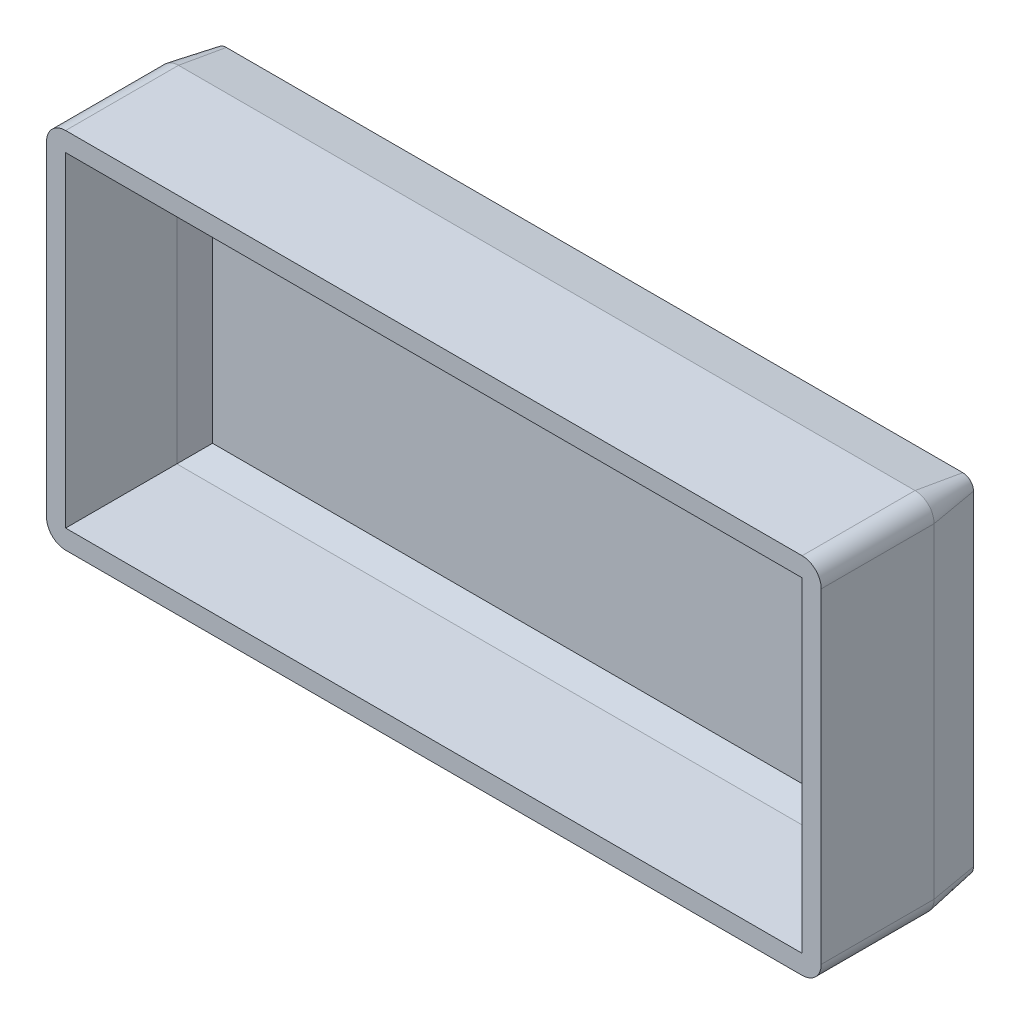
ISO-10303-21;
HEADER;
FILE_DESCRIPTION(('STEP AP214'),'2;1');
FILE_NAME('part.step','',(''),(''),'','','');
FILE_SCHEMA(('AUTOMOTIVE_DESIGN { 1 0 10303 214 1 1 1 1 }'));
ENDSEC;
DATA;
#1=APPLICATION_CONTEXT('core data for automotive mechanical design processes');
#2=APPLICATION_PROTOCOL_DEFINITION('international standard','automotive_design',2000,#1);
#3=PRODUCT_CONTEXT('',#1,'mechanical');
#4=PRODUCT('Part','Part','',(#3));
#5=PRODUCT_RELATED_PRODUCT_CATEGORY('part','',(#4));
#6=PRODUCT_DEFINITION_FORMATION('','',#4);
#7=PRODUCT_DEFINITION_CONTEXT('part definition',#1,'design');
#8=PRODUCT_DEFINITION('design','',#6,#7);
#9=PRODUCT_DEFINITION_SHAPE('','',#8);
#10=(LENGTH_UNIT() NAMED_UNIT(*) SI_UNIT(.MILLI.,.METRE.));
#11=(NAMED_UNIT(*) PLANE_ANGLE_UNIT() SI_UNIT($,.RADIAN.));
#12=(NAMED_UNIT(*) SI_UNIT($,.STERADIAN.) SOLID_ANGLE_UNIT());
#13=UNCERTAINTY_MEASURE_WITH_UNIT(LENGTH_MEASURE(1.E-05),#10,'distance_accuracy_value','');
#14=(GEOMETRIC_REPRESENTATION_CONTEXT(3) GLOBAL_UNCERTAINTY_ASSIGNED_CONTEXT((#13)) GLOBAL_UNIT_ASSIGNED_CONTEXT((#10,
#11,#12)) REPRESENTATION_CONTEXT('',''));
#15=CARTESIAN_POINT('',(0.,0.,0.));
#16=DIRECTION('',(0.,0.,1.));
#17=DIRECTION('',(1.,0.,0.));
#18=AXIS2_PLACEMENT_3D('',#15,#16,#17);
#19=CARTESIAN_POINT('',(19.25,8.49999999999999,5.9));
#20=DIRECTION('',(0.,0.,-1.));
#21=DIRECTION('',(-1.,0.,0.));
#22=AXIS2_PLACEMENT_3D('',#19,#20,#21);
#23=CYLINDRICAL_SURFACE('',#22,1.);
#24=CARTESIAN_POINT('',(19.25,8.49999999999999,0.));
#25=DIRECTION('',(0.,0.,1.));
#26=DIRECTION('',(1.,0.,0.));
#27=AXIS2_PLACEMENT_3D('',#24,#25,#26);
#28=CIRCLE('',#27,1.);
#29=CARTESIAN_POINT('',(20.25,8.49999999999999,0.));
#30=VERTEX_POINT('',#29);
#31=CARTESIAN_POINT('',(19.25,9.49999999999999,0.));
#32=VERTEX_POINT('',#31);
#33=EDGE_CURVE('E151',#30,#32,#28,.T.);
#34=ORIENTED_EDGE('',*,*,#33,.T.);
#35=DIRECTION('',(0.,0.,-1.));
#36=VECTOR('',#35,1.);
#37=CARTESIAN_POINT('',(19.25,9.49999999999999,5.9));
#38=LINE('',#37,#36);
#39=CARTESIAN_POINT('',(19.25,9.49999999999999,5.9));
#40=VERTEX_POINT('',#39);
#41=EDGE_CURVE('E184',#40,#32,#38,.T.);
#42=ORIENTED_EDGE('',*,*,#41,.F.);
#43=CARTESIAN_POINT('',(19.25,8.49999999999999,5.9));
#44=DIRECTION('',(0.,0.,1.));
#45=DIRECTION('',(1.,0.,0.));
#46=AXIS2_PLACEMENT_3D('',#43,#44,#45);
#47=CIRCLE('',#46,1.);
#48=CARTESIAN_POINT('',(20.25,8.49999999999999,5.9));
#49=VERTEX_POINT('',#48);
#50=EDGE_CURVE('E170',#49,#40,#47,.T.);
#51=ORIENTED_EDGE('',*,*,#50,.F.);
#52=DIRECTION('',(0.,0.,-1.));
#53=VECTOR('',#52,1.);
#54=CARTESIAN_POINT('',(20.25,8.49999999999999,5.9));
#55=LINE('',#54,#53);
#56=EDGE_CURVE('E147',#49,#30,#55,.T.);
#57=ORIENTED_EDGE('',*,*,#56,.T.);
#58=EDGE_LOOP('',(#34,#42,#51,#57));
#59=FACE_BOUND('',#58,.T.);
#60=ADVANCED_FACE('F33',(#59),#23,.T.);
#61=CARTESIAN_POINT('',(19.25,9.49999999999999,5.9));
#62=DIRECTION('',(0.,-1.,0.));
#63=DIRECTION('',(0.,0.,-1.));
#64=AXIS2_PLACEMENT_3D('',#61,#62,#63);
#65=PLANE('',#64);
#66=DIRECTION('',(-1.,0.,0.));
#67=VECTOR('',#66,1.);
#68=CARTESIAN_POINT('',(19.25,9.49999999999999,0.));
#69=LINE('',#68,#67);
#70=CARTESIAN_POINT('',(-19.25,9.49999999999999,0.));
#71=VERTEX_POINT('',#70);
#72=EDGE_CURVE('E154',#32,#71,#69,.T.);
#73=ORIENTED_EDGE('',*,*,#72,.T.);
#74=DIRECTION('',(0.,0.,-1.));
#75=VECTOR('',#74,1.);
#76=CARTESIAN_POINT('',(-19.25,9.49999999999999,5.9));
#77=LINE('',#76,#75);
#78=CARTESIAN_POINT('',(-19.25,9.49999999999999,5.9));
#79=VERTEX_POINT('',#78);
#80=EDGE_CURVE('E181',#79,#71,#77,.T.);
#81=ORIENTED_EDGE('',*,*,#80,.F.);
#82=DIRECTION('',(-1.,0.,0.));
#83=VECTOR('',#82,1.);
#84=CARTESIAN_POINT('',(19.25,9.49999999999999,5.9));
#85=LINE('',#84,#83);
#86=EDGE_CURVE('E314',#40,#79,#85,.T.);
#87=ORIENTED_EDGE('',*,*,#86,.F.);
#88=ORIENTED_EDGE('',*,*,#41,.T.);
#89=EDGE_LOOP('',(#73,#81,#87,#88));
#90=FACE_BOUND('',#89,.T.);
#91=ADVANCED_FACE('F354',(#90),#65,.F.);
#92=CARTESIAN_POINT('',(-19.25,8.49999999999999,5.9));
#93=DIRECTION('',(0.,0.,-1.));
#94=DIRECTION('',(-1.,0.,0.));
#95=AXIS2_PLACEMENT_3D('',#92,#93,#94);
#96=CYLINDRICAL_SURFACE('',#95,1.);
#97=CARTESIAN_POINT('',(-19.25,8.49999999999999,0.));
#98=DIRECTION('',(0.,0.,1.));
#99=DIRECTION('',(-1.,0.,0.));
#100=AXIS2_PLACEMENT_3D('',#97,#98,#99);
#101=CIRCLE('',#100,1.);
#102=CARTESIAN_POINT('',(-20.25,8.49999999999999,0.));
#103=VERTEX_POINT('',#102);
#104=EDGE_CURVE('E71',#71,#103,#101,.T.);
#105=ORIENTED_EDGE('',*,*,#104,.T.);
#106=DIRECTION('',(0.,0.,-1.));
#107=VECTOR('',#106,1.);
#108=CARTESIAN_POINT('',(-20.25,8.49999999999999,5.9));
#109=LINE('',#108,#107);
#110=CARTESIAN_POINT('',(-20.25,8.49999999999999,5.9));
#111=VERTEX_POINT('',#110);
#112=EDGE_CURVE('E178',#111,#103,#109,.T.);
#113=ORIENTED_EDGE('',*,*,#112,.F.);
#114=CARTESIAN_POINT('',(-19.25,8.49999999999999,5.9));
#115=DIRECTION('',(0.,0.,1.));
#116=DIRECTION('',(-1.,0.,0.));
#117=AXIS2_PLACEMENT_3D('',#114,#115,#116);
#118=CIRCLE('',#117,1.);
#119=EDGE_CURVE('E316',#79,#111,#118,.T.);
#120=ORIENTED_EDGE('',*,*,#119,.F.);
#121=ORIENTED_EDGE('',*,*,#80,.T.);
#122=EDGE_LOOP('',(#105,#113,#120,#121));
#123=FACE_BOUND('',#122,.T.);
#124=ADVANCED_FACE('F356',(#123),#96,.T.);
#125=CARTESIAN_POINT('',(-20.25,8.49999999999999,5.9));
#126=DIRECTION('',(1.,0.,0.));
#127=DIRECTION('',(0.,0.,-1.));
#128=AXIS2_PLACEMENT_3D('',#125,#126,#127);
#129=PLANE('',#128);
#130=DIRECTION('',(0.,-1.,0.));
#131=VECTOR('',#130,1.);
#132=CARTESIAN_POINT('',(-20.25,8.49999999999999,0.));
#133=LINE('',#132,#131);
#134=CARTESIAN_POINT('',(-20.25,-8.49999999999999,0.));
#135=VERTEX_POINT('',#134);
#136=EDGE_CURVE('E158',#103,#135,#133,.T.);
#137=ORIENTED_EDGE('',*,*,#136,.T.);
#138=DIRECTION('',(0.,0.,-1.));
#139=VECTOR('',#138,1.);
#140=CARTESIAN_POINT('',(-20.25,-8.49999999999999,5.9));
#141=LINE('',#140,#139);
#142=CARTESIAN_POINT('',(-20.25,-8.49999999999999,5.9));
#143=VERTEX_POINT('',#142);
#144=EDGE_CURVE('E175',#143,#135,#141,.T.);
#145=ORIENTED_EDGE('',*,*,#144,.F.);
#146=DIRECTION('',(0.,-1.,0.));
#147=VECTOR('',#146,1.);
#148=CARTESIAN_POINT('',(-20.25,8.49999999999999,5.9));
#149=LINE('',#148,#147);
#150=EDGE_CURVE('E318',#111,#143,#149,.T.);
#151=ORIENTED_EDGE('',*,*,#150,.F.);
#152=ORIENTED_EDGE('',*,*,#112,.T.);
#153=EDGE_LOOP('',(#137,#145,#151,#152));
#154=FACE_BOUND('',#153,.T.);
#155=ADVANCED_FACE('F324',(#154),#129,.F.);
#156=CARTESIAN_POINT('',(-19.25,-8.49999999999999,5.9));
#157=DIRECTION('',(0.,0.,-1.));
#158=DIRECTION('',(-1.,0.,0.));
#159=AXIS2_PLACEMENT_3D('',#156,#157,#158);
#160=CYLINDRICAL_SURFACE('',#159,1.);
#161=CARTESIAN_POINT('',(-19.25,-8.49999999999999,0.));
#162=DIRECTION('',(0.,0.,1.));
#163=DIRECTION('',(1.,0.,0.));
#164=AXIS2_PLACEMENT_3D('',#161,#162,#163);
#165=CIRCLE('',#164,1.);
#166=CARTESIAN_POINT('',(-19.25,-9.49999999999999,0.));
#167=VERTEX_POINT('',#166);
#168=EDGE_CURVE('E161',#135,#167,#165,.T.);
#169=ORIENTED_EDGE('',*,*,#168,.T.);
#170=DIRECTION('',(0.,0.,-1.));
#171=VECTOR('',#170,1.);
#172=CARTESIAN_POINT('',(-19.25,-9.49999999999999,5.9));
#173=LINE('',#172,#171);
#174=CARTESIAN_POINT('',(-19.25,-9.49999999999999,5.9));
#175=VERTEX_POINT('',#174);
#176=EDGE_CURVE('E141',#175,#167,#173,.T.);
#177=ORIENTED_EDGE('',*,*,#176,.F.);
#178=CARTESIAN_POINT('',(-19.25,-8.49999999999999,5.9));
#179=DIRECTION('',(0.,0.,1.));
#180=DIRECTION('',(1.,0.,0.));
#181=AXIS2_PLACEMENT_3D('',#178,#179,#180);
#182=CIRCLE('',#181,1.);
#183=EDGE_CURVE('E127',#143,#175,#182,.T.);
#184=ORIENTED_EDGE('',*,*,#183,.F.);
#185=ORIENTED_EDGE('',*,*,#144,.T.);
#186=EDGE_LOOP('',(#169,#177,#184,#185));
#187=FACE_BOUND('',#186,.T.);
#188=ADVANCED_FACE('F328',(#187),#160,.T.);
#189=CARTESIAN_POINT('',(-19.25,-9.49999999999999,5.9));
#190=DIRECTION('',(0.,1.,0.));
#191=DIRECTION('',(0.,0.,1.));
#192=AXIS2_PLACEMENT_3D('',#189,#190,#191);
#193=PLANE('',#192);
#194=DIRECTION('',(1.,0.,0.));
#195=VECTOR('',#194,1.);
#196=CARTESIAN_POINT('',(-19.25,-9.49999999999999,0.));
#197=LINE('',#196,#195);
#198=CARTESIAN_POINT('',(19.25,-9.49999999999999,0.));
#199=VERTEX_POINT('',#198);
#200=EDGE_CURVE('E138',#167,#199,#197,.T.);
#201=ORIENTED_EDGE('',*,*,#200,.T.);
#202=DIRECTION('',(0.,0.,-1.));
#203=VECTOR('',#202,1.);
#204=CARTESIAN_POINT('',(19.25,-9.49999999999999,5.9));
#205=LINE('',#204,#203);
#206=CARTESIAN_POINT('',(19.25,-9.49999999999999,5.9));
#207=VERTEX_POINT('',#206);
#208=EDGE_CURVE('E134',#207,#199,#205,.T.);
#209=ORIENTED_EDGE('',*,*,#208,.F.);
#210=DIRECTION('',(1.,0.,0.));
#211=VECTOR('',#210,1.);
#212=CARTESIAN_POINT('',(-19.25,-9.49999999999999,5.9));
#213=LINE('',#212,#211);
#214=EDGE_CURVE('E120',#175,#207,#213,.T.);
#215=ORIENTED_EDGE('',*,*,#214,.F.);
#216=ORIENTED_EDGE('',*,*,#176,.T.);
#217=EDGE_LOOP('',(#201,#209,#215,#216));
#218=FACE_BOUND('',#217,.T.);
#219=ADVANCED_FACE('F135',(#218),#193,.F.);
#220=CARTESIAN_POINT('',(19.25,-8.49999999999999,5.9));
#221=DIRECTION('',(0.,0.,-1.));
#222=DIRECTION('',(-1.,0.,0.));
#223=AXIS2_PLACEMENT_3D('',#220,#221,#222);
#224=CYLINDRICAL_SURFACE('',#223,1.);
#225=CARTESIAN_POINT('',(19.25,-8.49999999999999,0.));
#226=DIRECTION('',(0.,0.,1.));
#227=DIRECTION('',(1.,0.,0.));
#228=AXIS2_PLACEMENT_3D('',#225,#226,#227);
#229=CIRCLE('',#228,1.);
#230=CARTESIAN_POINT('',(20.25,-8.49999999999999,0.));
#231=VERTEX_POINT('',#230);
#232=EDGE_CURVE('E165',#199,#231,#229,.T.);
#233=ORIENTED_EDGE('',*,*,#232,.T.);
#234=DIRECTION('',(0.,0.,-1.));
#235=VECTOR('',#234,1.);
#236=CARTESIAN_POINT('',(20.25,-8.49999999999999,5.9));
#237=LINE('',#236,#235);
#238=CARTESIAN_POINT('',(20.25,-8.49999999999999,5.9));
#239=VERTEX_POINT('',#238);
#240=EDGE_CURVE('E142',#239,#231,#237,.T.);
#241=ORIENTED_EDGE('',*,*,#240,.F.);
#242=CARTESIAN_POINT('',(19.25,-8.49999999999999,5.9));
#243=DIRECTION('',(0.,0.,1.));
#244=DIRECTION('',(1.,0.,0.));
#245=AXIS2_PLACEMENT_3D('',#242,#243,#244);
#246=CIRCLE('',#245,1.);
#247=EDGE_CURVE('E124',#207,#239,#246,.T.);
#248=ORIENTED_EDGE('',*,*,#247,.F.);
#249=ORIENTED_EDGE('',*,*,#208,.T.);
#250=EDGE_LOOP('',(#233,#241,#248,#249));
#251=FACE_BOUND('',#250,.T.);
#252=ADVANCED_FACE('F144',(#251),#224,.T.);
#253=CARTESIAN_POINT('',(20.25,-8.49999999999999,5.9));
#254=DIRECTION('',(-1.,0.,0.));
#255=DIRECTION('',(0.,0.,1.));
#256=AXIS2_PLACEMENT_3D('',#253,#254,#255);
#257=PLANE('',#256);
#258=DIRECTION('',(0.,1.,0.));
#259=VECTOR('',#258,1.);
#260=CARTESIAN_POINT('',(20.25,-8.49999999999999,0.));
#261=LINE('',#260,#259);
#262=EDGE_CURVE('E167',#231,#30,#261,.T.);
#263=ORIENTED_EDGE('',*,*,#262,.T.);
#264=ORIENTED_EDGE('',*,*,#56,.F.);
#265=DIRECTION('',(0.,1.,0.));
#266=VECTOR('',#265,1.);
#267=CARTESIAN_POINT('',(20.25,-8.49999999999999,5.9));
#268=LINE('',#267,#266);
#269=EDGE_CURVE('E58',#239,#49,#268,.T.);
#270=ORIENTED_EDGE('',*,*,#269,.F.);
#271=ORIENTED_EDGE('',*,*,#240,.T.);
#272=EDGE_LOOP('',(#263,#264,#270,#271));
#273=FACE_BOUND('',#272,.T.);
#274=ADVANCED_FACE('F350',(#273),#257,.F.);
#275=CARTESIAN_POINT('',(19.25,8.49999999999999,5.9));
#276=DIRECTION('',(0.,0.,1.));
#277=DIRECTION('',(1.,0.,0.));
#278=AXIS2_PLACEMENT_3D('',#275,#276,#277);
#279=PLANE('',#278);
#280=DIRECTION('',(0.,1.,0.));
#281=VECTOR('',#280,1.);
#282=CARTESIAN_POINT('',(19.25,-8.49999999999999,5.9));
#283=LINE('',#282,#281);
#284=CARTESIAN_POINT('',(19.25,-8.49999999999999,5.9));
#285=VERTEX_POINT('',#284);
#286=CARTESIAN_POINT('',(19.25,8.49999999999999,5.9));
#287=VERTEX_POINT('',#286);
#288=EDGE_CURVE('E237',#285,#287,#283,.T.);
#289=ORIENTED_EDGE('',*,*,#288,.F.);
#290=DIRECTION('',(1.,0.,0.));
#291=VECTOR('',#290,1.);
#292=CARTESIAN_POINT('',(-19.25,-8.49999999999999,5.9));
#293=LINE('',#292,#291);
#294=CARTESIAN_POINT('',(-19.25,-8.49999999999999,5.9));
#295=VERTEX_POINT('',#294);
#296=EDGE_CURVE('E267',#295,#285,#293,.T.);
#297=ORIENTED_EDGE('',*,*,#296,.F.);
#298=DIRECTION('',(0.,-1.,0.));
#299=VECTOR('',#298,1.);
#300=CARTESIAN_POINT('',(-19.25,8.49999999999999,5.9));
#301=LINE('',#300,#299);
#302=CARTESIAN_POINT('',(-19.25,8.49999999999999,5.9));
#303=VERTEX_POINT('',#302);
#304=EDGE_CURVE('E265',#303,#295,#301,.T.);
#305=ORIENTED_EDGE('',*,*,#304,.F.);
#306=DIRECTION('',(-1.,0.,0.));
#307=VECTOR('',#306,1.);
#308=CARTESIAN_POINT('',(19.25,8.49999999999999,5.9));
#309=LINE('',#308,#307);
#310=EDGE_CURVE('E240',#287,#303,#309,.T.);
#311=ORIENTED_EDGE('',*,*,#310,.F.);
#312=EDGE_LOOP('',(#289,#297,#305,#311));
#313=FACE_BOUND('',#312,.T.);
#314=ORIENTED_EDGE('',*,*,#50,.T.);
#315=ORIENTED_EDGE('',*,*,#86,.T.);
#316=ORIENTED_EDGE('',*,*,#119,.T.);
#317=ORIENTED_EDGE('',*,*,#150,.T.);
#318=ORIENTED_EDGE('',*,*,#183,.T.);
#319=ORIENTED_EDGE('',*,*,#214,.T.);
#320=ORIENTED_EDGE('',*,*,#247,.T.);
#321=ORIENTED_EDGE('',*,*,#269,.T.);
#322=EDGE_LOOP('',(#314,#315,#316,#317,#318,#319,#320,#321));
#323=FACE_BOUND('',#322,.T.);
#324=ADVANCED_FACE('F122',(#313,#323),#279,.T.);
#325=CARTESIAN_POINT('',(19.25,8.49999999999999,0.));
#326=DIRECTION('',(0.,0.,1.));
#327=DIRECTION('',(1.,0.,0.));
#328=AXIS2_PLACEMENT_3D('',#325,#326,#327);
#329=CONICAL_SURFACE('',#328,1.,0.174532925199433);
#330=ORIENTED_EDGE('',*,*,#33,.F.);
#331=DIRECTION('',(0.173648177666931,0.,0.984807753012208));
#332=VECTOR('',#331,1.);
#333=CARTESIAN_POINT('',(20.25,8.49999999999999,0.));
#334=LINE('',#333,#332);
#335=CARTESIAN_POINT('',(19.8091825482288,8.49999999999999,-2.5));
#336=VERTEX_POINT('',#335);
#337=EDGE_CURVE('E83',#336,#30,#334,.T.);
#338=ORIENTED_EDGE('',*,*,#337,.F.);
#339=CARTESIAN_POINT('',(19.25,8.49999999999999,-2.5));
#340=DIRECTION('',(0.,0.,1.));
#341=DIRECTION('',(1.,0.,0.));
#342=AXIS2_PLACEMENT_3D('',#339,#340,#341);
#343=CIRCLE('',#342,0.559182548228837);
#344=CARTESIAN_POINT('',(19.25,9.05918254822883,-2.5));
#345=VERTEX_POINT('',#344);
#346=EDGE_CURVE('E262',#336,#345,#343,.T.);
#347=ORIENTED_EDGE('',*,*,#346,.T.);
#348=DIRECTION('',(0.,0.173648177666931,0.984807753012208));
#349=VECTOR('',#348,1.);
#350=CARTESIAN_POINT('',(19.25,9.49999999999999,0.));
#351=LINE('',#350,#349);
#352=EDGE_CURVE('E273',#345,#32,#351,.T.);
#353=ORIENTED_EDGE('',*,*,#352,.T.);
#354=EDGE_LOOP('',(#330,#338,#347,#353));
#355=FACE_BOUND('',#354,.T.);
#356=ADVANCED_FACE('F344',(#355),#329,.T.);
#357=CARTESIAN_POINT('',(20.25,-8.49999999999999,0.));
#358=DIRECTION('',(0.984807753012208,0.,-0.173648177666931));
#359=DIRECTION('',(-0.173648177666931,0.,-0.984807753012208));
#360=AXIS2_PLACEMENT_3D('',#357,#358,#359);
#361=PLANE('',#360);
#362=ORIENTED_EDGE('',*,*,#262,.F.);
#363=DIRECTION('',(0.173648177666931,0.,0.984807753012208));
#364=VECTOR('',#363,1.);
#365=CARTESIAN_POINT('',(20.25,-8.49999999999999,0.));
#366=LINE('',#365,#364);
#367=CARTESIAN_POINT('',(19.8091825482288,-8.49999999999999,-2.5));
#368=VERTEX_POINT('',#367);
#369=EDGE_CURVE('E272',#368,#231,#366,.T.);
#370=ORIENTED_EDGE('',*,*,#369,.F.);
#371=DIRECTION('',(0.,1.,0.));
#372=VECTOR('',#371,1.);
#373=CARTESIAN_POINT('',(19.8091825482288,8.49999999999999,-2.5));
#374=LINE('',#373,#372);
#375=EDGE_CURVE('E277',#368,#336,#374,.T.);
#376=ORIENTED_EDGE('',*,*,#375,.T.);
#377=ORIENTED_EDGE('',*,*,#337,.T.);
#378=EDGE_LOOP('',(#362,#370,#376,#377));
#379=FACE_BOUND('',#378,.T.);
#380=ADVANCED_FACE('F342',(#379),#361,.T.);
#381=CARTESIAN_POINT('',(19.25,-8.49999999999999,0.));
#382=DIRECTION('',(0.,0.,1.));
#383=DIRECTION('',(1.,0.,0.));
#384=AXIS2_PLACEMENT_3D('',#381,#382,#383);
#385=CONICAL_SURFACE('',#384,1.,0.174532925199433);
#386=ORIENTED_EDGE('',*,*,#232,.F.);
#387=DIRECTION('',(0.,-0.173648177666931,0.984807753012208));
#388=VECTOR('',#387,1.);
#389=CARTESIAN_POINT('',(19.25,-9.49999999999999,0.));
#390=LINE('',#389,#388);
#391=CARTESIAN_POINT('',(19.25,-9.05918254822883,-2.5));
#392=VERTEX_POINT('',#391);
#393=EDGE_CURVE('E287',#392,#199,#390,.T.);
#394=ORIENTED_EDGE('',*,*,#393,.F.);
#395=CARTESIAN_POINT('',(19.25,-8.49999999999999,-2.5));
#396=DIRECTION('',(0.,0.,1.));
#397=DIRECTION('',(1.,0.,0.));
#398=AXIS2_PLACEMENT_3D('',#395,#396,#397);
#399=CIRCLE('',#398,0.559182548228837);
#400=EDGE_CURVE('E296',#392,#368,#399,.T.);
#401=ORIENTED_EDGE('',*,*,#400,.T.);
#402=ORIENTED_EDGE('',*,*,#369,.T.);
#403=EDGE_LOOP('',(#386,#394,#401,#402));
#404=FACE_BOUND('',#403,.T.);
#405=ADVANCED_FACE('F463',(#404),#385,.T.);
#406=CARTESIAN_POINT('',(-19.25,-9.49999999999999,0.));
#407=DIRECTION('',(0.,-0.984807753012208,-0.173648177666931));
#408=DIRECTION('',(0.,0.173648177666931,-0.984807753012208));
#409=AXIS2_PLACEMENT_3D('',#406,#407,#408);
#410=PLANE('',#409);
#411=ORIENTED_EDGE('',*,*,#200,.F.);
#412=DIRECTION('',(0.,-0.173648177666931,0.984807753012208));
#413=VECTOR('',#412,1.);
#414=CARTESIAN_POINT('',(-19.25,-9.49999999999999,0.));
#415=LINE('',#414,#413);
#416=CARTESIAN_POINT('',(-19.25,-9.05918254822883,-2.5));
#417=VERTEX_POINT('',#416);
#418=EDGE_CURVE('E284',#417,#167,#415,.T.);
#419=ORIENTED_EDGE('',*,*,#418,.F.);
#420=DIRECTION('',(1.,0.,0.));
#421=VECTOR('',#420,1.);
#422=CARTESIAN_POINT('',(19.25,-9.05918254822883,-2.5));
#423=LINE('',#422,#421);
#424=EDGE_CURVE('E299',#417,#392,#423,.T.);
#425=ORIENTED_EDGE('',*,*,#424,.T.);
#426=ORIENTED_EDGE('',*,*,#393,.T.);
#427=EDGE_LOOP('',(#411,#419,#425,#426));
#428=FACE_BOUND('',#427,.T.);
#429=ADVANCED_FACE('F471',(#428),#410,.T.);
#430=CARTESIAN_POINT('',(-19.25,-8.49999999999999,0.));
#431=DIRECTION('',(0.,0.,1.));
#432=DIRECTION('',(1.,0.,0.));
#433=AXIS2_PLACEMENT_3D('',#430,#431,#432);
#434=CONICAL_SURFACE('',#433,1.,0.174532925199433);
#435=ORIENTED_EDGE('',*,*,#168,.F.);
#436=DIRECTION('',(-0.173648177666931,0.,0.984807753012208));
#437=VECTOR('',#436,1.);
#438=CARTESIAN_POINT('',(-20.25,-8.49999999999999,0.));
#439=LINE('',#438,#437);
#440=CARTESIAN_POINT('',(-19.8091825482288,-8.49999999999999,-2.5));
#441=VERTEX_POINT('',#440);
#442=EDGE_CURVE('E281',#441,#135,#439,.T.);
#443=ORIENTED_EDGE('',*,*,#442,.F.);
#444=CARTESIAN_POINT('',(-19.25,-8.49999999999999,-2.5));
#445=DIRECTION('',(0.,0.,1.));
#446=DIRECTION('',(1.,0.,0.));
#447=AXIS2_PLACEMENT_3D('',#444,#445,#446);
#448=CIRCLE('',#447,0.559182548228837);
#449=EDGE_CURVE('E302',#441,#417,#448,.T.);
#450=ORIENTED_EDGE('',*,*,#449,.T.);
#451=ORIENTED_EDGE('',*,*,#418,.T.);
#452=EDGE_LOOP('',(#435,#443,#450,#451));
#453=FACE_BOUND('',#452,.T.);
#454=ADVANCED_FACE('F480',(#453),#434,.T.);
#455=CARTESIAN_POINT('',(-20.25,8.49999999999999,0.));
#456=DIRECTION('',(-0.984807753012208,0.,-0.173648177666931));
#457=DIRECTION('',(-0.173648177666931,0.,0.984807753012208));
#458=AXIS2_PLACEMENT_3D('',#455,#456,#457);
#459=PLANE('',#458);
#460=ORIENTED_EDGE('',*,*,#136,.F.);
#461=DIRECTION('',(-0.173648177666931,0.,0.984807753012208));
#462=VECTOR('',#461,1.);
#463=CARTESIAN_POINT('',(-20.25,8.49999999999999,0.));
#464=LINE('',#463,#462);
#465=CARTESIAN_POINT('',(-19.8091825482288,8.49999999999999,-2.5));
#466=VERTEX_POINT('',#465);
#467=EDGE_CURVE('E279',#466,#103,#464,.T.);
#468=ORIENTED_EDGE('',*,*,#467,.F.);
#469=DIRECTION('',(0.,-1.,0.));
#470=VECTOR('',#469,1.);
#471=CARTESIAN_POINT('',(-19.8091825482288,8.49999999999999,-2.5));
#472=LINE('',#471,#470);
#473=EDGE_CURVE('E305',#466,#441,#472,.T.);
#474=ORIENTED_EDGE('',*,*,#473,.T.);
#475=ORIENTED_EDGE('',*,*,#442,.T.);
#476=EDGE_LOOP('',(#460,#468,#474,#475));
#477=FACE_BOUND('',#476,.T.);
#478=ADVANCED_FACE('F490',(#477),#459,.T.);
#479=CARTESIAN_POINT('',(-19.25,8.49999999999999,0.));
#480=DIRECTION('',(0.,0.,1.));
#481=DIRECTION('',(-1.,0.,0.));
#482=AXIS2_PLACEMENT_3D('',#479,#480,#481);
#483=CONICAL_SURFACE('',#482,1.,0.174532925199433);
#484=ORIENTED_EDGE('',*,*,#104,.F.);
#485=DIRECTION('',(0.,0.173648177666931,0.984807753012208));
#486=VECTOR('',#485,1.);
#487=CARTESIAN_POINT('',(-19.25,9.49999999999999,0.));
#488=LINE('',#487,#486);
#489=CARTESIAN_POINT('',(-19.25,9.05918254822883,-2.5));
#490=VERTEX_POINT('',#489);
#491=EDGE_CURVE('E276',#490,#71,#488,.T.);
#492=ORIENTED_EDGE('',*,*,#491,.F.);
#493=CARTESIAN_POINT('',(-19.25,8.49999999999999,-2.5));
#494=DIRECTION('',(0.,0.,1.));
#495=DIRECTION('',(1.,0.,0.));
#496=AXIS2_PLACEMENT_3D('',#493,#494,#495);
#497=CIRCLE('',#496,0.559182548228837);
#498=EDGE_CURVE('E308',#490,#466,#497,.T.);
#499=ORIENTED_EDGE('',*,*,#498,.T.);
#500=ORIENTED_EDGE('',*,*,#467,.T.);
#501=EDGE_LOOP('',(#484,#492,#499,#500));
#502=FACE_BOUND('',#501,.T.);
#503=ADVANCED_FACE('F499',(#502),#483,.T.);
#504=CARTESIAN_POINT('',(19.25,9.49999999999999,0.));
#505=DIRECTION('',(0.,0.984807753012208,-0.173648177666931));
#506=DIRECTION('',(0.,0.173648177666931,0.984807753012208));
#507=AXIS2_PLACEMENT_3D('',#504,#505,#506);
#508=PLANE('',#507);
#509=ORIENTED_EDGE('',*,*,#72,.F.);
#510=ORIENTED_EDGE('',*,*,#352,.F.);
#511=DIRECTION('',(-1.,0.,0.));
#512=VECTOR('',#511,1.);
#513=CARTESIAN_POINT('',(19.25,9.05918254822883,-2.5));
#514=LINE('',#513,#512);
#515=EDGE_CURVE('E293',#345,#490,#514,.T.);
#516=ORIENTED_EDGE('',*,*,#515,.T.);
#517=ORIENTED_EDGE('',*,*,#491,.T.);
#518=EDGE_LOOP('',(#509,#510,#516,#517));
#519=FACE_BOUND('',#518,.T.);
#520=ADVANCED_FACE('F509',(#519),#508,.T.);
#521=CARTESIAN_POINT('',(19.25,8.49999999999999,-2.5));
#522=DIRECTION('',(0.,0.,1.));
#523=DIRECTION('',(1.,0.,0.));
#524=AXIS2_PLACEMENT_3D('',#521,#522,#523);
#525=PLANE('',#524);
#526=CARTESIAN_POINT('',(18.3091825482288,-7.55918254822883,-2.5));
#527=DIRECTION('',(0.,0.,-1.));
#528=DIRECTION('',(-1.,0.,0.));
#529=AXIS2_PLACEMENT_3D('',#526,#527,#528);
#530=CIRCLE('',#529,0.549999999999999);
#531=CARTESIAN_POINT('',(17.7591825482288,-7.55918254822883,-2.5));
#532=VERTEX_POINT('',#531);
#533=EDGE_CURVE('E190',#532,#532,#530,.T.);
#534=ORIENTED_EDGE('',*,*,#533,.F.);
#535=EDGE_LOOP('',(#534));
#536=FACE_BOUND('',#535,.T.);
#537=CARTESIAN_POINT('',(18.3091825482288,7.55918254822883,-2.5));
#538=DIRECTION('',(0.,0.,-1.));
#539=DIRECTION('',(1.,0.,0.));
#540=AXIS2_PLACEMENT_3D('',#537,#538,#539);
#541=CIRCLE('',#540,0.549999999999999);
#542=CARTESIAN_POINT('',(18.8591825482288,7.55918254822883,-2.5));
#543=VERTEX_POINT('',#542);
#544=EDGE_CURVE('E196',#543,#543,#541,.T.);
#545=ORIENTED_EDGE('',*,*,#544,.F.);
#546=EDGE_LOOP('',(#545));
#547=FACE_BOUND('',#546,.T.);
#548=CARTESIAN_POINT('',(-10.9500000000011,1.75375639708157E-12,-2.5));
#549=DIRECTION('',(0.,0.,1.));
#550=DIRECTION('',(1.,0.,0.));
#551=AXIS2_PLACEMENT_3D('',#548,#549,#550);
#552=CIRCLE('',#551,3.5);
#553=CARTESIAN_POINT('',(-7.4500000000011,1.75375639708157E-12,-2.5));
#554=VERTEX_POINT('',#553);
#555=EDGE_CURVE('E41',#554,#554,#552,.F.);
#556=ORIENTED_EDGE('',*,*,#555,.F.);
#557=EDGE_LOOP('',(#556));
#558=FACE_BOUND('',#557,.T.);
#559=ORIENTED_EDGE('',*,*,#346,.F.);
#560=ORIENTED_EDGE('',*,*,#375,.F.);
#561=ORIENTED_EDGE('',*,*,#400,.F.);
#562=ORIENTED_EDGE('',*,*,#424,.F.);
#563=ORIENTED_EDGE('',*,*,#449,.F.);
#564=ORIENTED_EDGE('',*,*,#473,.F.);
#565=ORIENTED_EDGE('',*,*,#498,.F.);
#566=ORIENTED_EDGE('',*,*,#515,.F.);
#567=EDGE_LOOP('',(#559,#560,#561,#562,#563,#564,#565,#566));
#568=FACE_BOUND('',#567,.T.);
#569=ADVANCED_FACE('F517',(#536,#547,#558,#568),#525,.F.);
#570=CARTESIAN_POINT('',(19.25,8.49999999999999,5.9));
#571=DIRECTION('',(0.,-1.,0.));
#572=DIRECTION('',(0.,0.,-1.));
#573=AXIS2_PLACEMENT_3D('',#570,#571,#572);
#574=PLANE('',#573);
#575=DIRECTION('',(-1.,0.,0.));
#576=VECTOR('',#575,1.);
#577=CARTESIAN_POINT('',(19.25,8.49999999999999,0.0874886635259242));
#578=LINE('',#577,#576);
#579=CARTESIAN_POINT('',(19.25,8.49999999999999,0.0874886635259253));
#580=VERTEX_POINT('',#579);
#581=CARTESIAN_POINT('',(-19.25,8.49999999999999,0.0874886635259243));
#582=VERTEX_POINT('',#581);
#583=EDGE_CURVE('E215',#580,#582,#578,.T.);
#584=ORIENTED_EDGE('',*,*,#583,.F.);
#585=DIRECTION('',(0.,0.,-1.));
#586=VECTOR('',#585,1.);
#587=CARTESIAN_POINT('',(19.25,8.49999999999999,5.9));
#588=LINE('',#587,#586);
#589=EDGE_CURVE('E223',#287,#580,#588,.T.);
#590=ORIENTED_EDGE('',*,*,#589,.F.);
#591=ORIENTED_EDGE('',*,*,#310,.T.);
#592=DIRECTION('',(0.,0.,-1.));
#593=VECTOR('',#592,1.);
#594=CARTESIAN_POINT('',(-19.25,8.49999999999999,5.9));
#595=LINE('',#594,#593);
#596=EDGE_CURVE('E220',#303,#582,#595,.T.);
#597=ORIENTED_EDGE('',*,*,#596,.T.);
#598=EDGE_LOOP('',(#584,#590,#591,#597));
#599=FACE_BOUND('',#598,.T.);
#600=ADVANCED_FACE('F392',(#599),#574,.T.);
#601=CARTESIAN_POINT('',(-19.25,8.49999999999999,5.9));
#602=DIRECTION('',(1.,0.,0.));
#603=DIRECTION('',(0.,0.,-1.));
#604=AXIS2_PLACEMENT_3D('',#601,#602,#603);
#605=PLANE('',#604);
#606=DIRECTION('',(0.,-1.,0.));
#607=VECTOR('',#606,1.);
#608=CARTESIAN_POINT('',(-19.25,8.49999999999999,0.0874886635259242));
#609=LINE('',#608,#607);
#610=CARTESIAN_POINT('',(-19.25,-8.49999999999999,0.0874886635259243));
#611=VERTEX_POINT('',#610);
#612=EDGE_CURVE('E218',#582,#611,#609,.T.);
#613=ORIENTED_EDGE('',*,*,#612,.F.);
#614=ORIENTED_EDGE('',*,*,#596,.F.);
#615=ORIENTED_EDGE('',*,*,#304,.T.);
#616=DIRECTION('',(0.,0.,-1.));
#617=VECTOR('',#616,1.);
#618=CARTESIAN_POINT('',(-19.25,-8.49999999999999,5.9));
#619=LINE('',#618,#617);
#620=EDGE_CURVE('E49',#295,#611,#619,.T.);
#621=ORIENTED_EDGE('',*,*,#620,.T.);
#622=EDGE_LOOP('',(#613,#614,#615,#621));
#623=FACE_BOUND('',#622,.T.);
#624=ADVANCED_FACE('F397',(#623),#605,.T.);
#625=CARTESIAN_POINT('',(-19.25,-8.49999999999999,5.9));
#626=DIRECTION('',(0.,1.,0.));
#627=DIRECTION('',(0.,0.,1.));
#628=AXIS2_PLACEMENT_3D('',#625,#626,#627);
#629=PLANE('',#628);
#630=DIRECTION('',(1.,0.,0.));
#631=VECTOR('',#630,1.);
#632=CARTESIAN_POINT('',(-19.25,-8.49999999999999,0.0874886635259242));
#633=LINE('',#632,#631);
#634=CARTESIAN_POINT('',(19.25,-8.49999999999999,0.0874886635259243));
#635=VERTEX_POINT('',#634);
#636=EDGE_CURVE('E229',#611,#635,#633,.T.);
#637=ORIENTED_EDGE('',*,*,#636,.F.);
#638=ORIENTED_EDGE('',*,*,#620,.F.);
#639=ORIENTED_EDGE('',*,*,#296,.T.);
#640=DIRECTION('',(0.,0.,-1.));
#641=VECTOR('',#640,1.);
#642=CARTESIAN_POINT('',(19.25,-8.49999999999999,5.9));
#643=LINE('',#642,#641);
#644=EDGE_CURVE('E231',#285,#635,#643,.T.);
#645=ORIENTED_EDGE('',*,*,#644,.T.);
#646=EDGE_LOOP('',(#637,#638,#639,#645));
#647=FACE_BOUND('',#646,.T.);
#648=ADVANCED_FACE('F411',(#647),#629,.T.);
#649=CARTESIAN_POINT('',(19.25,-8.49999999999999,5.9));
#650=DIRECTION('',(-1.,0.,0.));
#651=DIRECTION('',(0.,0.,1.));
#652=AXIS2_PLACEMENT_3D('',#649,#650,#651);
#653=PLANE('',#652);
#654=DIRECTION('',(0.,1.,0.));
#655=VECTOR('',#654,1.);
#656=CARTESIAN_POINT('',(19.25,-8.49999999999999,0.0874886635259242));
#657=LINE('',#656,#655);
#658=EDGE_CURVE('E234',#635,#580,#657,.T.);
#659=ORIENTED_EDGE('',*,*,#658,.F.);
#660=ORIENTED_EDGE('',*,*,#644,.F.);
#661=ORIENTED_EDGE('',*,*,#288,.T.);
#662=ORIENTED_EDGE('',*,*,#589,.T.);
#663=EDGE_LOOP('',(#659,#660,#661,#662));
#664=FACE_BOUND('',#663,.T.);
#665=ADVANCED_FACE('F406',(#664),#653,.T.);
#666=CARTESIAN_POINT('',(19.2651922469878,-8.49999999999999,0.173648177666931));
#667=DIRECTION('',(0.984807753012208,0.,-0.173648177666931));
#668=DIRECTION('',(-0.173648177666931,0.,-0.984807753012208));
#669=AXIS2_PLACEMENT_3D('',#666,#667,#668);
#670=PLANE('',#669);
#671=ORIENTED_EDGE('',*,*,#658,.T.);
#672=DIRECTION('',(-0.171087869746036,-0.171087869746036,-0.970287525247814));
#673=VECTOR('',#672,1.);
#674=CARTESIAN_POINT('',(19.2647475538272,8.51474755382722,0.171126197430086));
#675=LINE('',#674,#673);
#676=CARTESIAN_POINT('',(18.9700829170516,8.22008291705155,-1.5));
#677=VERTEX_POINT('',#676);
#678=EDGE_CURVE('E226',#580,#677,#675,.T.);
#679=ORIENTED_EDGE('',*,*,#678,.T.);
#680=DIRECTION('',(0.,1.,0.));
#681=VECTOR('',#680,1.);
#682=CARTESIAN_POINT('',(18.9700829170516,8.49999999999999,-1.5));
#683=LINE('',#682,#681);
#684=CARTESIAN_POINT('',(18.9700829170516,-8.22008291705155,-1.5));
#685=VERTEX_POINT('',#684);
#686=EDGE_CURVE('E219',#685,#677,#683,.T.);
#687=ORIENTED_EDGE('',*,*,#686,.F.);
#688=DIRECTION('',(-0.171087869746036,0.171087869746036,-0.970287525247814));
#689=VECTOR('',#688,1.);
#690=CARTESIAN_POINT('',(19.2647475538272,-8.51474755382722,0.171126197430086));
#691=LINE('',#690,#689);
#692=EDGE_CURVE('E253',#635,#685,#691,.T.);
#693=ORIENTED_EDGE('',*,*,#692,.F.);
#694=EDGE_LOOP('',(#671,#679,#687,#693));
#695=FACE_BOUND('',#694,.T.);
#696=ADVANCED_FACE('F402',(#695),#670,.F.);
#697=CARTESIAN_POINT('',(-19.25,-8.51519224698779,0.173648177666931));
#698=DIRECTION('',(0.,-0.984807753012208,-0.173648177666931));
#699=DIRECTION('',(0.,0.173648177666931,-0.984807753012208));
#700=AXIS2_PLACEMENT_3D('',#697,#698,#699);
#701=PLANE('',#700);
#702=ORIENTED_EDGE('',*,*,#636,.T.);
#703=ORIENTED_EDGE('',*,*,#692,.T.);
#704=DIRECTION('',(1.,0.,0.));
#705=VECTOR('',#704,1.);
#706=CARTESIAN_POINT('',(19.25,-8.22008291705155,-1.5));
#707=LINE('',#706,#705);
#708=CARTESIAN_POINT('',(-18.9700829170516,-8.22008291705155,-1.5));
#709=VERTEX_POINT('',#708);
#710=EDGE_CURVE('E243',#709,#685,#707,.T.);
#711=ORIENTED_EDGE('',*,*,#710,.F.);
#712=DIRECTION('',(0.171087869746036,0.171087869746036,-0.970287525247814));
#713=VECTOR('',#712,1.);
#714=CARTESIAN_POINT('',(-19.2647475538272,-8.51474755382722,0.171126197430086));
#715=LINE('',#714,#713);
#716=EDGE_CURVE('E256',#611,#709,#715,.T.);
#717=ORIENTED_EDGE('',*,*,#716,.F.);
#718=EDGE_LOOP('',(#702,#703,#711,#717));
#719=FACE_BOUND('',#718,.T.);
#720=ADVANCED_FACE('F409',(#719),#701,.F.);
#721=CARTESIAN_POINT('',(-19.2651922469878,8.49999999999999,0.173648177666931));
#722=DIRECTION('',(-0.984807753012208,0.,-0.173648177666931));
#723=DIRECTION('',(-0.173648177666931,0.,0.984807753012208));
#724=AXIS2_PLACEMENT_3D('',#721,#722,#723);
#725=PLANE('',#724);
#726=ORIENTED_EDGE('',*,*,#612,.T.);
#727=ORIENTED_EDGE('',*,*,#716,.T.);
#728=DIRECTION('',(0.,-1.,0.));
#729=VECTOR('',#728,1.);
#730=CARTESIAN_POINT('',(-18.9700829170516,8.49999999999999,-1.5));
#731=LINE('',#730,#729);
#732=CARTESIAN_POINT('',(-18.9700829170516,8.22008291705155,-1.5));
#733=VERTEX_POINT('',#732);
#734=EDGE_CURVE('E246',#733,#709,#731,.T.);
#735=ORIENTED_EDGE('',*,*,#734,.F.);
#736=DIRECTION('',(0.171087869746036,-0.171087869746036,-0.970287525247814));
#737=VECTOR('',#736,1.);
#738=CARTESIAN_POINT('',(-19.2647475538272,8.51474755382722,0.171126197430086));
#739=LINE('',#738,#737);
#740=EDGE_CURVE('E259',#582,#733,#739,.T.);
#741=ORIENTED_EDGE('',*,*,#740,.F.);
#742=EDGE_LOOP('',(#726,#727,#735,#741));
#743=FACE_BOUND('',#742,.T.);
#744=ADVANCED_FACE('F385',(#743),#725,.F.);
#745=CARTESIAN_POINT('',(19.25,8.51519224698779,0.173648177666931));
#746=DIRECTION('',(0.,0.984807753012208,-0.173648177666931));
#747=DIRECTION('',(0.,0.173648177666931,0.984807753012208));
#748=AXIS2_PLACEMENT_3D('',#745,#746,#747);
#749=PLANE('',#748);
#750=ORIENTED_EDGE('',*,*,#583,.T.);
#751=ORIENTED_EDGE('',*,*,#740,.T.);
#752=DIRECTION('',(-1.,0.,0.));
#753=VECTOR('',#752,1.);
#754=CARTESIAN_POINT('',(19.25,8.22008291705155,-1.5));
#755=LINE('',#754,#753);
#756=EDGE_CURVE('E214',#677,#733,#755,.T.);
#757=ORIENTED_EDGE('',*,*,#756,.F.);
#758=ORIENTED_EDGE('',*,*,#678,.F.);
#759=EDGE_LOOP('',(#750,#751,#757,#758));
#760=FACE_BOUND('',#759,.T.);
#761=ADVANCED_FACE('F399',(#760),#749,.F.);
#762=CARTESIAN_POINT('',(19.25,8.49999999999999,-1.5));
#763=DIRECTION('',(0.,0.,1.));
#764=DIRECTION('',(1.,0.,0.));
#765=AXIS2_PLACEMENT_3D('',#762,#763,#764);
#766=PLANE('',#765);
#767=CARTESIAN_POINT('',(18.3091825482288,-7.55918254822883,-1.5));
#768=DIRECTION('',(0.,0.,1.));
#769=DIRECTION('',(1.,0.,0.));
#770=AXIS2_PLACEMENT_3D('',#767,#768,#769);
#771=CIRCLE('',#770,0.549999999999999);
#772=CARTESIAN_POINT('',(18.8591825482288,-7.55918254822883,-1.5));
#773=VERTEX_POINT('',#772);
#774=EDGE_CURVE('E36',#773,#773,#771,.T.);
#775=ORIENTED_EDGE('',*,*,#774,.F.);
#776=EDGE_LOOP('',(#775));
#777=FACE_BOUND('',#776,.T.);
#778=CARTESIAN_POINT('',(18.3091825482288,7.55918254822883,-1.5));
#779=DIRECTION('',(0.,0.,1.));
#780=DIRECTION('',(1.,0.,0.));
#781=AXIS2_PLACEMENT_3D('',#778,#779,#780);
#782=CIRCLE('',#781,0.549999999999999);
#783=CARTESIAN_POINT('',(18.8591825482288,7.55918254822883,-1.5));
#784=VERTEX_POINT('',#783);
#785=EDGE_CURVE('E188',#784,#784,#782,.T.);
#786=ORIENTED_EDGE('',*,*,#785,.F.);
#787=EDGE_LOOP('',(#786));
#788=FACE_BOUND('',#787,.T.);
#789=ORIENTED_EDGE('',*,*,#756,.T.);
#790=ORIENTED_EDGE('',*,*,#734,.T.);
#791=ORIENTED_EDGE('',*,*,#710,.T.);
#792=ORIENTED_EDGE('',*,*,#686,.T.);
#793=EDGE_LOOP('',(#789,#790,#791,#792));
#794=FACE_BOUND('',#793,.T.);
#795=ADVANCED_FACE('F593',(#777,#788,#794),#766,.T.);
#796=CARTESIAN_POINT('',(-10.9500000000011,1.75375639708157E-12,-3.));
#797=DIRECTION('',(0.,0.,1.));
#798=DIRECTION('',(1.,0.,0.));
#799=AXIS2_PLACEMENT_3D('',#796,#797,#798);
#800=CYLINDRICAL_SURFACE('',#799,3.5);
#801=CARTESIAN_POINT('',(-10.9500000000011,1.75375639708157E-12,-3.));
#802=DIRECTION('',(0.,0.,-1.));
#803=DIRECTION('',(-1.,0.,0.));
#804=AXIS2_PLACEMENT_3D('',#801,#802,#803);
#805=CIRCLE('',#804,3.5);
#806=CARTESIAN_POINT('',(-14.4500000000011,1.75375639708157E-12,-3.));
#807=VERTEX_POINT('',#806);
#808=EDGE_CURVE('E209',#807,#807,#805,.T.);
#809=ORIENTED_EDGE('',*,*,#808,.F.);
#810=EDGE_LOOP('',(#809));
#811=FACE_BOUND('',#810,.T.);
#812=ORIENTED_EDGE('',*,*,#555,.T.);
#813=EDGE_LOOP('',(#812));
#814=FACE_BOUND('',#813,.T.);
#815=ADVANCED_FACE('F600',(#811,#814),#800,.T.);
#816=CARTESIAN_POINT('',(-10.9500000000011,1.75375639708157E-12,-3.));
#817=DIRECTION('',(0.,0.,-1.));
#818=DIRECTION('',(-1.,0.,0.));
#819=AXIS2_PLACEMENT_3D('',#816,#817,#818);
#820=PLANE('',#819);
#821=CARTESIAN_POINT('',(-10.950000000001,1.92554433073833E-12,-3.));
#822=DIRECTION('',(0.,0.,-1.));
#823=DIRECTION('',(-1.,0.,0.));
#824=AXIS2_PLACEMENT_3D('',#821,#822,#823);
#825=CIRCLE('',#824,2.65000000000008);
#826=CARTESIAN_POINT('',(-13.600000000001,1.92554433073833E-12,-3.));
#827=VERTEX_POINT('',#826);
#828=EDGE_CURVE('E205',#827,#827,#825,.T.);
#829=ORIENTED_EDGE('',*,*,#828,.F.);
#830=EDGE_LOOP('',(#829));
#831=FACE_BOUND('',#830,.T.);
#832=ORIENTED_EDGE('',*,*,#808,.T.);
#833=EDGE_LOOP('',(#832));
#834=FACE_BOUND('',#833,.T.);
#835=ADVANCED_FACE('F605',(#831,#834),#820,.T.);
#836=CARTESIAN_POINT('',(-10.950000000001,1.92554433073833E-12,-7.));
#837=DIRECTION('',(0.,0.,-1.));
#838=DIRECTION('',(-1.,0.,0.));
#839=AXIS2_PLACEMENT_3D('',#836,#837,#838);
#840=PLANE('',#839);
#841=CARTESIAN_POINT('',(-10.950000000001,1.92554433073833E-12,-7.));
#842=DIRECTION('',(0.,0.,-1.));
#843=DIRECTION('',(-1.,0.,0.));
#844=AXIS2_PLACEMENT_3D('',#841,#842,#843);
#845=CIRCLE('',#844,2.65000000000008);
#846=CARTESIAN_POINT('',(-13.600000000001,1.92554433073833E-12,-7.));
#847=VERTEX_POINT('',#846);
#848=EDGE_CURVE('E206',#847,#847,#845,.T.);
#849=ORIENTED_EDGE('',*,*,#848,.T.);
#850=EDGE_LOOP('',(#849));
#851=FACE_BOUND('',#850,.T.);
#852=CARTESIAN_POINT('',(-10.950000000001,1.92554433073833E-12,-7.));
#853=DIRECTION('',(0.,0.,-1.));
#854=DIRECTION('',(-1.,0.,0.));
#855=AXIS2_PLACEMENT_3D('',#852,#853,#854);
#856=CIRCLE('',#855,1.80000000000008);
#857=CARTESIAN_POINT('',(-12.750000000001,1.92554433073833E-12,-7.));
#858=VERTEX_POINT('',#857);
#859=EDGE_CURVE('E194',#858,#858,#856,.T.);
#860=ORIENTED_EDGE('',*,*,#859,.F.);
#861=EDGE_LOOP('',(#860));
#862=FACE_BOUND('',#861,.T.);
#863=ADVANCED_FACE('F615',(#851,#862),#840,.T.);
#864=CARTESIAN_POINT('',(-10.950000000001,1.92554433073833E-12,-7.));
#865=DIRECTION('',(0.,0.,1.));
#866=DIRECTION('',(1.,0.,0.));
#867=AXIS2_PLACEMENT_3D('',#864,#865,#866);
#868=CYLINDRICAL_SURFACE('',#867,2.65000000000008);
#869=ORIENTED_EDGE('',*,*,#848,.F.);
#870=EDGE_LOOP('',(#869));
#871=FACE_BOUND('',#870,.T.);
#872=ORIENTED_EDGE('',*,*,#828,.T.);
#873=EDGE_LOOP('',(#872));
#874=FACE_BOUND('',#873,.T.);
#875=ADVANCED_FACE('F627',(#871,#874),#868,.T.);
#876=CARTESIAN_POINT('',(-10.950000000001,1.92554433073833E-12,-7.));
#877=DIRECTION('',(0.,0.,1.));
#878=DIRECTION('',(1.,0.,0.));
#879=AXIS2_PLACEMENT_3D('',#876,#877,#878);
#880=CYLINDRICAL_SURFACE('',#879,1.80000000000008);
#881=ORIENTED_EDGE('',*,*,#859,.T.);
#882=EDGE_LOOP('',(#881));
#883=FACE_BOUND('',#882,.T.);
#884=CARTESIAN_POINT('',(-10.950000000001,1.92554433073833E-12,-3.));
#885=DIRECTION('',(0.,0.,-1.));
#886=DIRECTION('',(-1.,0.,0.));
#887=AXIS2_PLACEMENT_3D('',#884,#885,#886);
#888=CIRCLE('',#887,1.80000000000008);
#889=CARTESIAN_POINT('',(-12.750000000001,1.92554433073833E-12,-3.));
#890=VERTEX_POINT('',#889);
#891=EDGE_CURVE('E11',#890,#890,#888,.F.);
#892=ORIENTED_EDGE('',*,*,#891,.T.);
#893=EDGE_LOOP('',(#892));
#894=FACE_BOUND('',#893,.T.);
#895=ADVANCED_FACE('F637',(#883,#894),#880,.F.);
#896=ORIENTED_EDGE('',*,*,#891,.F.);
#897=EDGE_LOOP('',(#896));
#898=FACE_BOUND('',#897,.T.);
#899=ADVANCED_FACE('F618',(#898),#820,.T.);
#900=CARTESIAN_POINT('',(18.3091825482288,7.55918254822883,7.5));
#901=DIRECTION('',(0.,0.,-1.));
#902=DIRECTION('',(-1.,0.,0.));
#903=AXIS2_PLACEMENT_3D('',#900,#901,#902);
#904=CYLINDRICAL_SURFACE('',#903,0.549999999999999);
#905=ORIENTED_EDGE('',*,*,#785,.T.);
#906=EDGE_LOOP('',(#905));
#907=FACE_BOUND('',#906,.T.);
#908=ORIENTED_EDGE('',*,*,#544,.T.);
#909=EDGE_LOOP('',(#908));
#910=FACE_BOUND('',#909,.T.);
#911=ADVANCED_FACE('F656',(#907,#910),#904,.F.);
#912=CARTESIAN_POINT('',(18.3091825482288,-7.55918254822883,7.5));
#913=DIRECTION('',(0.,0.,-1.));
#914=DIRECTION('',(-1.,0.,0.));
#915=AXIS2_PLACEMENT_3D('',#912,#913,#914);
#916=CYLINDRICAL_SURFACE('',#915,0.549999999999999);
#917=ORIENTED_EDGE('',*,*,#774,.T.);
#918=EDGE_LOOP('',(#917));
#919=FACE_BOUND('',#918,.T.);
#920=ORIENTED_EDGE('',*,*,#533,.T.);
#921=EDGE_LOOP('',(#920));
#922=FACE_BOUND('',#921,.T.);
#923=ADVANCED_FACE('F678',(#919,#922),#916,.F.);
#924=CLOSED_SHELL('',(#60,#91,#124,#155,#188,#219,#252,#274,#324,#356,#380,#405,#429,#454,#478,
#503,#520,#569,#600,#624,#648,#665,#696,#720,#744,#761,#795,#815,#835,#863,#875,#895,#899,#911,#923));
#925=MANIFOLD_SOLID_BREP('B2',#924);
#926=ADVANCED_BREP_SHAPE_REPRESENTATION('',(#18,#925),#14);
#927=SHAPE_DEFINITION_REPRESENTATION(#9,#926);
ENDSEC;
END-ISO-10303-21;
